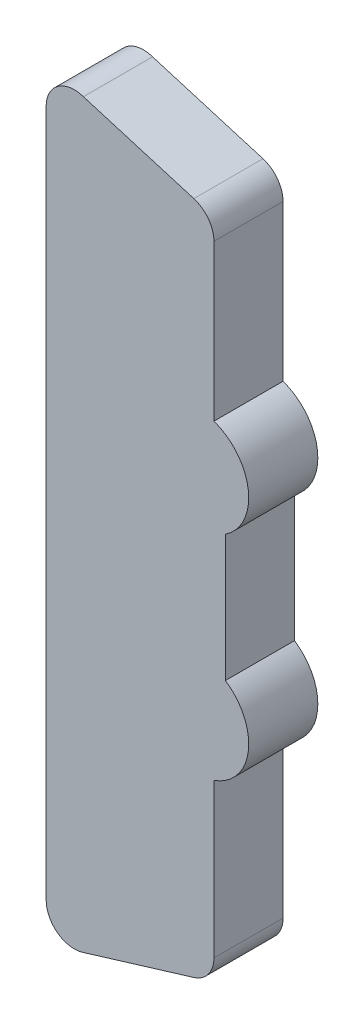
ISO-10303-21;
HEADER;
FILE_DESCRIPTION(('STEP AP214'),'2;1');
FILE_NAME('part.step','',(''),(''),'','','');
FILE_SCHEMA(('AUTOMOTIVE_DESIGN { 1 0 10303 214 1 1 1 1 }'));
ENDSEC;
DATA;
#1=APPLICATION_CONTEXT('core data for automotive mechanical design processes');
#2=APPLICATION_PROTOCOL_DEFINITION('international standard','automotive_design',2000,#1);
#3=PRODUCT_CONTEXT('',#1,'mechanical');
#4=PRODUCT('Part','Part','',(#3));
#5=PRODUCT_RELATED_PRODUCT_CATEGORY('part','',(#4));
#6=PRODUCT_DEFINITION_FORMATION('','',#4);
#7=PRODUCT_DEFINITION_CONTEXT('part definition',#1,'design');
#8=PRODUCT_DEFINITION('design','',#6,#7);
#9=PRODUCT_DEFINITION_SHAPE('','',#8);
#10=(LENGTH_UNIT() NAMED_UNIT(*) SI_UNIT(.MILLI.,.METRE.));
#11=(NAMED_UNIT(*) PLANE_ANGLE_UNIT() SI_UNIT($,.RADIAN.));
#12=(NAMED_UNIT(*) SI_UNIT($,.STERADIAN.) SOLID_ANGLE_UNIT());
#13=UNCERTAINTY_MEASURE_WITH_UNIT(LENGTH_MEASURE(1.E-05),#10,'distance_accuracy_value','');
#14=(GEOMETRIC_REPRESENTATION_CONTEXT(3) GLOBAL_UNCERTAINTY_ASSIGNED_CONTEXT((#13)) GLOBAL_UNIT_ASSIGNED_CONTEXT((#10,
#11,#12)) REPRESENTATION_CONTEXT('',''));
#15=CARTESIAN_POINT('',(0.,0.,0.));
#16=DIRECTION('',(0.,0.,1.));
#17=DIRECTION('',(1.,0.,0.));
#18=AXIS2_PLACEMENT_3D('',#15,#16,#17);
#19=CARTESIAN_POINT('',(1.843145736911,-2.901266792211,-6.124));
#20=DIRECTION('',(0.,0.,1.));
#21=DIRECTION('',(0.,-1.,0.));
#22=AXIS2_PLACEMENT_3D('',#19,#20,#21);
#23=CYLINDRICAL_SURFACE('',#22,0.898396092362);
#24=DIRECTION('',(0.,0.,-1.));
#25=VECTOR('',#24,1.);
#26=CARTESIAN_POINT('',(2.336495846622,-2.150453094933,-4.9));
#27=LINE('',#26,#25);
#28=CARTESIAN_POINT('',(2.336495846622,-2.150453094933,-4.9));
#29=VERTEX_POINT('',#28);
#30=CARTESIAN_POINT('',(2.336495846622,-2.150453094933,-6.1));
#31=VERTEX_POINT('',#30);
#32=EDGE_CURVE('E191',#29,#31,#27,.T.);
#33=ORIENTED_EDGE('',*,*,#32,.F.);
#34=CARTESIAN_POINT('',(1.843145736911,-2.901266792211,-4.9));
#35=DIRECTION('',(0.,0.,1.));
#36=DIRECTION('',(0.327867375855509,-0.944723760603925,0.));
#37=AXIS2_PLACEMENT_3D('',#34,#35,#36);
#38=CIRCLE('',#37,0.898396092362);
#39=CARTESIAN_POINT('',(2.137700506192,-3.7500029271,-4.9));
#40=VERTEX_POINT('',#39);
#41=EDGE_CURVE('E214',#40,#29,#38,.T.);
#42=ORIENTED_EDGE('',*,*,#41,.F.);
#43=DIRECTION('',(0.,0.,1.));
#44=VECTOR('',#43,1.);
#45=CARTESIAN_POINT('',(2.137700506192,-3.7500029271,-6.1));
#46=LINE('',#45,#44);
#47=CARTESIAN_POINT('',(2.137700506193,-3.750002927099,-6.1));
#48=VERTEX_POINT('',#47);
#49=EDGE_CURVE('E11',#48,#40,#46,.T.);
#50=ORIENTED_EDGE('',*,*,#49,.F.);
#51=CARTESIAN_POINT('',(1.843145736911,-2.901266792211,-6.1));
#52=DIRECTION('',(0.,0.,1.));
#53=DIRECTION('',(0.327867375855509,-0.944723760603925,0.));
#54=AXIS2_PLACEMENT_3D('',#51,#52,#53);
#55=CIRCLE('',#54,0.898396092362);
#56=EDGE_CURVE('E162',#48,#31,#55,.T.);
#57=ORIENTED_EDGE('',*,*,#56,.T.);
#58=EDGE_LOOP('',(#33,#42,#50,#57));
#59=FACE_BOUND('',#58,.T.);
#60=ADVANCED_FACE('F16',(#59),#23,.T.);
#61=CARTESIAN_POINT('',(2.137700506192,-5.085332010509,-5.5));
#62=DIRECTION('',(1.,0.,0.));
#63=DIRECTION('',(0.,1.,0.));
#64=AXIS2_PLACEMENT_3D('',#61,#62,#63);
#65=PLANE('',#64);
#66=ORIENTED_EDGE('',*,*,#49,.T.);
#67=DIRECTION('',(0.,1.,0.));
#68=VECTOR('',#67,1.);
#69=CARTESIAN_POINT('',(2.137700506192,-6.420661093917,-4.9));
#70=LINE('',#69,#68);
#71=CARTESIAN_POINT('',(2.137700506192,-6.420661093917,-4.9));
#72=VERTEX_POINT('',#71);
#73=EDGE_CURVE('E145',#72,#40,#70,.T.);
#74=ORIENTED_EDGE('',*,*,#73,.F.);
#75=DIRECTION('',(0.,0.,-1.));
#76=VECTOR('',#75,1.);
#77=CARTESIAN_POINT('',(2.137700506192,-6.420661093917,-4.9));
#78=LINE('',#77,#76);
#79=CARTESIAN_POINT('',(2.137700506192,-6.420661093917,-6.1));
#80=VERTEX_POINT('',#79);
#81=EDGE_CURVE('E27',#72,#80,#78,.T.);
#82=ORIENTED_EDGE('',*,*,#81,.T.);
#83=DIRECTION('',(0.,1.,0.));
#84=VECTOR('',#83,1.);
#85=CARTESIAN_POINT('',(2.137700506192,-6.420661093917,-6.1));
#86=LINE('',#85,#84);
#87=EDGE_CURVE('E142',#80,#48,#86,.T.);
#88=ORIENTED_EDGE('',*,*,#87,.T.);
#89=EDGE_LOOP('',(#66,#74,#82,#88));
#90=FACE_BOUND('',#89,.T.);
#91=ADVANCED_FACE('F140',(#90),#65,.T.);
#92=CARTESIAN_POINT('',(1.648694605368,-6.420661093918,-6.124));
#93=DIRECTION('',(0.,0.,1.));
#94=DIRECTION('',(0.,-1.,0.));
#95=AXIS2_PLACEMENT_3D('',#92,#93,#94);
#96=CYLINDRICAL_SURFACE('',#95,0.489005900824);
#97=ORIENTED_EDGE('',*,*,#81,.F.);
#98=CARTESIAN_POINT('',(1.648694605368,-6.420661093918,-4.9));
#99=DIRECTION('',(0.,0.,1.));
#100=DIRECTION('',(0.276992230070707,-0.960872158239824,0.));
#101=AXIS2_PLACEMENT_3D('',#98,#99,#100);
#102=CIRCLE('',#101,0.489005900824);
#103=CARTESIAN_POINT('',(1.784145440353,-6.890533249235,-4.9));
#104=VERTEX_POINT('',#103);
#105=EDGE_CURVE('E179',#104,#72,#102,.T.);
#106=ORIENTED_EDGE('',*,*,#105,.F.);
#107=DIRECTION('',(0.,0.,1.));
#108=VECTOR('',#107,1.);
#109=CARTESIAN_POINT('',(1.784145440353,-6.890533249235,-6.1));
#110=LINE('',#109,#108);
#111=CARTESIAN_POINT('',(1.784145440355,-6.890533249235,-6.1));
#112=VERTEX_POINT('',#111);
#113=EDGE_CURVE('E20',#112,#104,#110,.T.);
#114=ORIENTED_EDGE('',*,*,#113,.F.);
#115=CARTESIAN_POINT('',(1.648694605368,-6.420661093918,-6.1));
#116=DIRECTION('',(0.,0.,1.));
#117=DIRECTION('',(0.276992230070707,-0.960872158239824,0.));
#118=AXIS2_PLACEMENT_3D('',#115,#116,#117);
#119=CIRCLE('',#118,0.489005900824);
#120=EDGE_CURVE('E152',#112,#80,#119,.T.);
#121=ORIENTED_EDGE('',*,*,#120,.T.);
#122=EDGE_LOOP('',(#97,#106,#114,#121));
#123=FACE_BOUND('',#122,.T.);
#124=ADVANCED_FACE('F153',(#123),#96,.T.);
#125=CARTESIAN_POINT('',(0.8201642685116,-7.183462876419,-5.5));
#126=DIRECTION('',(-0.290747403268612,0.956799847142839,0.));
#127=DIRECTION('',(0.,0.,1.));
#128=AXIS2_PLACEMENT_3D('',#125,#126,#127);
#129=PLANE('',#128);
#130=ORIENTED_EDGE('',*,*,#113,.T.);
#131=DIRECTION('',(0.956799847142783,0.290747403268795,0.));
#132=VECTOR('',#131,1.);
#133=CARTESIAN_POINT('',(-0.1438169033289,-7.476392503602,-4.9));
#134=LINE('',#133,#132);
#135=CARTESIAN_POINT('',(-0.1438169033289,-7.476392503602,-4.9));
#136=VERTEX_POINT('',#135);
#137=EDGE_CURVE('E182',#136,#104,#134,.T.);
#138=ORIENTED_EDGE('',*,*,#137,.F.);
#139=DIRECTION('',(0.,0.,-1.));
#140=VECTOR('',#139,1.);
#141=CARTESIAN_POINT('',(-0.1438169033289,-7.476392503602,-4.9));
#142=LINE('',#141,#140);
#143=CARTESIAN_POINT('',(-0.1438169033289,-7.476392503602,-6.1));
#144=VERTEX_POINT('',#143);
#145=EDGE_CURVE('E257',#136,#144,#142,.T.);
#146=ORIENTED_EDGE('',*,*,#145,.T.);
#147=DIRECTION('',(0.956799847142783,0.290747403268795,0.));
#148=VECTOR('',#147,1.);
#149=CARTESIAN_POINT('',(-0.1438169033289,-7.476392503602,-6.1));
#150=LINE('',#149,#148);
#151=EDGE_CURVE('E158',#144,#112,#150,.T.);
#152=ORIENTED_EDGE('',*,*,#151,.T.);
#153=EDGE_LOOP('',(#130,#138,#146,#152));
#154=FACE_BOUND('',#153,.T.);
#155=ADVANCED_FACE('F333',(#154),#129,.F.);
#156=CARTESIAN_POINT('',(-0.2859940991763,-7.008511732442,-6.124));
#157=DIRECTION('',(0.,0.,1.));
#158=DIRECTION('',(0.,-1.,0.));
#159=AXIS2_PLACEMENT_3D('',#156,#157,#158);
#160=CYLINDRICAL_SURFACE('',#159,0.489005900824);
#161=ORIENTED_EDGE('',*,*,#145,.F.);
#162=CARTESIAN_POINT('',(-0.2859940991763,-7.008511732442,-4.9));
#163=DIRECTION('',(0.,0.,1.));
#164=DIRECTION('',(-1.,-8.18240388103E-12,0.));
#165=AXIS2_PLACEMENT_3D('',#162,#163,#164);
#166=CIRCLE('',#165,0.489005900824);
#167=CARTESIAN_POINT('',(-0.7749999999999,-7.008511732443,-4.9));
#168=VERTEX_POINT('',#167);
#169=EDGE_CURVE('E183',#168,#136,#166,.T.);
#170=ORIENTED_EDGE('',*,*,#169,.F.);
#171=DIRECTION('',(0.,0.,1.));
#172=VECTOR('',#171,1.);
#173=CARTESIAN_POINT('',(-0.7749999999999,-7.008511732443,-6.1));
#174=LINE('',#173,#172);
#175=CARTESIAN_POINT('',(-0.7750000000003,-7.008511732446,-6.1));
#176=VERTEX_POINT('',#175);
#177=EDGE_CURVE('E195',#176,#168,#174,.T.);
#178=ORIENTED_EDGE('',*,*,#177,.F.);
#179=CARTESIAN_POINT('',(-0.2859940991763,-7.008511732442,-6.1));
#180=DIRECTION('',(0.,0.,1.));
#181=DIRECTION('',(-1.,-8.18240388103E-12,0.));
#182=AXIS2_PLACEMENT_3D('',#179,#180,#181);
#183=CIRCLE('',#182,0.489005900824);
#184=EDGE_CURVE('E175',#176,#144,#183,.T.);
#185=ORIENTED_EDGE('',*,*,#184,.T.);
#186=EDGE_LOOP('',(#161,#170,#178,#185));
#187=FACE_BOUND('',#186,.T.);
#188=ADVANCED_FACE('F296',(#187),#160,.T.);
#189=CARTESIAN_POINT('',(-0.7749999999996,-1.037707341434,-5.5));
#190=DIRECTION('',(1.,0.,0.));
#191=DIRECTION('',(0.,1.,0.));
#192=AXIS2_PLACEMENT_3D('',#189,#190,#191);
#193=PLANE('',#192);
#194=ORIENTED_EDGE('',*,*,#177,.T.);
#195=DIRECTION('',(0.,-1.,0.));
#196=VECTOR('',#195,1.);
#197=CARTESIAN_POINT('',(-0.7749999999999,4.933097049575,-4.9));
#198=LINE('',#197,#196);
#199=CARTESIAN_POINT('',(-0.7749999999999,4.933097049575,-4.9));
#200=VERTEX_POINT('',#199);
#201=EDGE_CURVE('E187',#200,#168,#198,.T.);
#202=ORIENTED_EDGE('',*,*,#201,.F.);
#203=DIRECTION('',(0.,0.,-1.));
#204=VECTOR('',#203,1.);
#205=CARTESIAN_POINT('',(-0.7749999999999,4.933097049575,-4.9));
#206=LINE('',#205,#204);
#207=CARTESIAN_POINT('',(-0.7749999999999,4.933097049575,-6.1));
#208=VERTEX_POINT('',#207);
#209=EDGE_CURVE('E192',#200,#208,#206,.T.);
#210=ORIENTED_EDGE('',*,*,#209,.T.);
#211=DIRECTION('',(0.,-1.,0.));
#212=VECTOR('',#211,1.);
#213=CARTESIAN_POINT('',(-0.7749999999999,4.933097049575,-6.1));
#214=LINE('',#213,#212);
#215=EDGE_CURVE('E178',#208,#176,#214,.T.);
#216=ORIENTED_EDGE('',*,*,#215,.T.);
#217=EDGE_LOOP('',(#194,#202,#210,#216));
#218=FACE_BOUND('',#217,.T.);
#219=ADVANCED_FACE('F18',(#218),#193,.F.);
#220=CARTESIAN_POINT('',(-0.2859940991763,4.933097049574,-6.124));
#221=DIRECTION('',(0.,0.,1.));
#222=DIRECTION('',(0.,-1.,0.));
#223=AXIS2_PLACEMENT_3D('',#220,#221,#222);
#224=CYLINDRICAL_SURFACE('',#223,0.489005900824);
#225=ORIENTED_EDGE('',*,*,#209,.F.);
#226=CARTESIAN_POINT('',(-0.2859940991763,4.933097049574,-4.9));
#227=DIRECTION('',(0.,0.,1.));
#228=DIRECTION('',(-1.579040482591E-13,1.,0.));
#229=AXIS2_PLACEMENT_3D('',#226,#227,#228);
#230=CIRCLE('',#229,0.489005900824);
#231=CARTESIAN_POINT('',(-0.1277505710148,5.395791070323,-4.9));
#232=VERTEX_POINT('',#231);
#233=EDGE_CURVE('E222',#232,#200,#230,.T.);
#234=ORIENTED_EDGE('',*,*,#233,.F.);
#235=DIRECTION('',(0.,0.,1.));
#236=VECTOR('',#235,1.);
#237=CARTESIAN_POINT('',(-0.1277505710148,5.395791070323,-6.1));
#238=LINE('',#237,#236);
#239=CARTESIAN_POINT('',(-0.1277505709889,5.395791070313,-6.1));
#240=VERTEX_POINT('',#239);
#241=EDGE_CURVE('E173',#240,#232,#238,.T.);
#242=ORIENTED_EDGE('',*,*,#241,.F.);
#243=CARTESIAN_POINT('',(-0.2859940991763,4.933097049574,-6.1));
#244=DIRECTION('',(0.,0.,1.));
#245=DIRECTION('',(0.323602492159694,0.946193123557784,0.));
#246=AXIS2_PLACEMENT_3D('',#243,#244,#245);
#247=CIRCLE('',#246,0.489005900824);
#248=EDGE_CURVE('E196',#240,#208,#247,.T.);
#249=ORIENTED_EDGE('',*,*,#248,.T.);
#250=EDGE_LOOP('',(#225,#234,#242,#249));
#251=FACE_BOUND('',#250,.T.);
#252=ADVANCED_FACE('F306',(#251),#224,.T.);
#253=CARTESIAN_POINT('',(0.8305758915877,5.108977733794,-5.5));
#254=DIRECTION('',(0.286719952863708,0.958014440720928,0.));
#255=DIRECTION('',(0.,0.,-1.));
#256=AXIS2_PLACEMENT_3D('',#253,#254,#255);
#257=PLANE('',#256);
#258=ORIENTED_EDGE('',*,*,#241,.T.);
#259=DIRECTION('',(-0.958014440720928,0.286719952863708,0.));
#260=VECTOR('',#259,1.);
#261=CARTESIAN_POINT('',(1.788902354202,4.822164397262,-4.9));
#262=LINE('',#261,#260);
#263=CARTESIAN_POINT('',(1.788902354202,4.822164397262,-4.9));
#264=VERTEX_POINT('',#263);
#265=EDGE_CURVE('E205',#264,#232,#262,.T.);
#266=ORIENTED_EDGE('',*,*,#265,.F.);
#267=DIRECTION('',(0.,0.,-1.));
#268=VECTOR('',#267,1.);
#269=CARTESIAN_POINT('',(1.788902354202,4.822164397262,-4.9));
#270=LINE('',#269,#268);
#271=CARTESIAN_POINT('',(1.788902354202,4.822164397262,-6.1));
#272=VERTEX_POINT('',#271);
#273=EDGE_CURVE('E105',#264,#272,#270,.T.);
#274=ORIENTED_EDGE('',*,*,#273,.T.);
#275=DIRECTION('',(-0.958014440720928,0.286719952863708,0.));
#276=VECTOR('',#275,1.);
#277=CARTESIAN_POINT('',(1.788902354202,4.822164397262,-6.1));
#278=LINE('',#277,#276);
#279=EDGE_CURVE('E199',#272,#240,#278,.T.);
#280=ORIENTED_EDGE('',*,*,#279,.T.);
#281=EDGE_LOOP('',(#258,#266,#274,#280));
#282=FACE_BOUND('',#281,.T.);
#283=ADVANCED_FACE('F309',(#282),#257,.T.);
#284=CARTESIAN_POINT('',(1.648694605368,4.353689682675,-6.124));
#285=DIRECTION('',(0.,0.,1.));
#286=DIRECTION('',(0.,-1.,0.));
#287=AXIS2_PLACEMENT_3D('',#284,#285,#286);
#288=CYLINDRICAL_SURFACE('',#287,0.489005900824);
#289=ORIENTED_EDGE('',*,*,#273,.F.);
#290=CARTESIAN_POINT('',(1.648694605368,4.353689682675,-4.9));
#291=DIRECTION('',(0.,0.,1.));
#292=DIRECTION('',(1.,-6.139073278109E-12,0.));
#293=AXIS2_PLACEMENT_3D('',#290,#291,#292);
#294=CIRCLE('',#293,0.489005900824);
#295=CARTESIAN_POINT('',(2.137700506192,4.353689682674,-4.9));
#296=VERTEX_POINT('',#295);
#297=EDGE_CURVE('E201',#296,#264,#294,.T.);
#298=ORIENTED_EDGE('',*,*,#297,.F.);
#299=DIRECTION('',(0.,0.,1.));
#300=VECTOR('',#299,1.);
#301=CARTESIAN_POINT('',(2.137700506192,4.353689682674,-6.1));
#302=LINE('',#301,#300);
#303=CARTESIAN_POINT('',(2.137700506192,4.353689682672,-6.1));
#304=VERTEX_POINT('',#303);
#305=EDGE_CURVE('E94',#304,#296,#302,.T.);
#306=ORIENTED_EDGE('',*,*,#305,.F.);
#307=CARTESIAN_POINT('',(1.648694605368,4.353689682675,-6.1));
#308=DIRECTION('',(0.,0.,1.));
#309=DIRECTION('',(1.,-6.13725698424E-12,0.));
#310=AXIS2_PLACEMENT_3D('',#307,#308,#309);
#311=CIRCLE('',#310,0.489005900824);
#312=EDGE_CURVE('E243',#304,#272,#311,.T.);
#313=ORIENTED_EDGE('',*,*,#312,.T.);
#314=EDGE_LOOP('',(#289,#298,#306,#313));
#315=FACE_BOUND('',#314,.T.);
#316=ADVANCED_FACE('F273',(#315),#288,.T.);
#317=CARTESIAN_POINT('',(2.137700506192,3.001869792121,-5.5));
#318=DIRECTION('',(1.,0.,0.));
#319=DIRECTION('',(0.,1.,0.));
#320=AXIS2_PLACEMENT_3D('',#317,#318,#319);
#321=PLANE('',#320);
#322=ORIENTED_EDGE('',*,*,#305,.T.);
#323=DIRECTION('',(0.,1.,0.));
#324=VECTOR('',#323,1.);
#325=CARTESIAN_POINT('',(2.137700506192,1.650049901567,-4.9));
#326=LINE('',#325,#324);
#327=CARTESIAN_POINT('',(2.137700506192,1.650049901567,-4.9));
#328=VERTEX_POINT('',#327);
#329=EDGE_CURVE('E206',#328,#296,#326,.T.);
#330=ORIENTED_EDGE('',*,*,#329,.F.);
#331=DIRECTION('',(0.,0.,-1.));
#332=VECTOR('',#331,1.);
#333=CARTESIAN_POINT('',(2.137700506192,1.650049901567,-4.9));
#334=LINE('',#333,#332);
#335=CARTESIAN_POINT('',(2.137700506192,1.650049901567,-6.1));
#336=VERTEX_POINT('',#335);
#337=EDGE_CURVE('E41',#328,#336,#334,.T.);
#338=ORIENTED_EDGE('',*,*,#337,.T.);
#339=DIRECTION('',(0.,1.,0.));
#340=VECTOR('',#339,1.);
#341=CARTESIAN_POINT('',(2.137700506192,1.650049901567,-6.1));
#342=LINE('',#341,#340);
#343=EDGE_CURVE('E240',#336,#304,#342,.T.);
#344=ORIENTED_EDGE('',*,*,#343,.T.);
#345=EDGE_LOOP('',(#322,#330,#338,#344));
#346=FACE_BOUND('',#345,.T.);
#347=ADVANCED_FACE('F272',(#346),#321,.T.);
#348=CARTESIAN_POINT('',(1.843145736911,0.801313766678,-6.124));
#349=DIRECTION('',(0.,0.,1.));
#350=DIRECTION('',(0.,-1.,0.));
#351=AXIS2_PLACEMENT_3D('',#348,#349,#350);
#352=CYLINDRICAL_SURFACE('',#351,0.8983960923624);
#353=ORIENTED_EDGE('',*,*,#337,.F.);
#354=CARTESIAN_POINT('',(1.843145736911,0.801313766678,-4.9));
#355=DIRECTION('',(0.,0.,1.));
#356=DIRECTION('',(0.549145431403533,-0.83572680653945,0.));
#357=AXIS2_PLACEMENT_3D('',#354,#355,#356);
#358=CIRCLE('',#357,0.8983960923624);
#359=CARTESIAN_POINT('',(2.336495846622,0.05050006939991,-4.9));
#360=VERTEX_POINT('',#359);
#361=EDGE_CURVE('E218',#360,#328,#358,.T.);
#362=ORIENTED_EDGE('',*,*,#361,.F.);
#363=DIRECTION('',(0.,0.,1.));
#364=VECTOR('',#363,1.);
#365=CARTESIAN_POINT('',(2.336495846622,0.05050006939991,-6.1));
#366=LINE('',#365,#364);
#367=CARTESIAN_POINT('',(2.336495846622,0.05050006939991,-6.1));
#368=VERTEX_POINT('',#367);
#369=EDGE_CURVE('E223',#368,#360,#366,.T.);
#370=ORIENTED_EDGE('',*,*,#369,.F.);
#371=CARTESIAN_POINT('',(1.843145736911,0.801313766678,-6.1));
#372=DIRECTION('',(0.,0.,1.));
#373=DIRECTION('',(0.549145431403533,-0.83572680653945,0.));
#374=AXIS2_PLACEMENT_3D('',#371,#372,#373);
#375=CIRCLE('',#374,0.8983960923624);
#376=EDGE_CURVE('E235',#368,#336,#375,.T.);
#377=ORIENTED_EDGE('',*,*,#376,.T.);
#378=EDGE_LOOP('',(#353,#362,#370,#377));
#379=FACE_BOUND('',#378,.T.);
#380=ADVANCED_FACE('F270',(#379),#352,.T.);
#381=CARTESIAN_POINT('',(0.9833332052649,-1.037707341434,-6.1));
#382=DIRECTION('',(0.,0.,1.));
#383=DIRECTION('',(1.,0.,0.));
#384=AXIS2_PLACEMENT_3D('',#381,#382,#383);
#385=PLANE('',#384);
#386=ORIENTED_EDGE('',*,*,#56,.F.);
#387=ORIENTED_EDGE('',*,*,#87,.F.);
#388=ORIENTED_EDGE('',*,*,#120,.F.);
#389=ORIENTED_EDGE('',*,*,#151,.F.);
#390=ORIENTED_EDGE('',*,*,#184,.F.);
#391=ORIENTED_EDGE('',*,*,#215,.F.);
#392=ORIENTED_EDGE('',*,*,#248,.F.);
#393=ORIENTED_EDGE('',*,*,#279,.F.);
#394=ORIENTED_EDGE('',*,*,#312,.F.);
#395=ORIENTED_EDGE('',*,*,#343,.F.);
#396=ORIENTED_EDGE('',*,*,#376,.F.);
#397=DIRECTION('',(0.,1.,0.));
#398=VECTOR('',#397,1.);
#399=CARTESIAN_POINT('',(2.336495846622,-2.150453094933,-6.1));
#400=LINE('',#399,#398);
#401=EDGE_CURVE('E169',#31,#368,#400,.T.);
#402=ORIENTED_EDGE('',*,*,#401,.F.);
#403=EDGE_LOOP('',(#386,#387,#388,#389,#390,#391,#392,#393,#394,#395,#396,#402));
#404=FACE_BOUND('',#403,.T.);
#405=ADVANCED_FACE('F160',(#404),#385,.F.);
#406=CARTESIAN_POINT('',(2.336495846622,-1.049976512767,-5.5));
#407=DIRECTION('',(1.,0.,0.));
#408=DIRECTION('',(0.,1.,0.));
#409=AXIS2_PLACEMENT_3D('',#406,#407,#408);
#410=PLANE('',#409);
#411=ORIENTED_EDGE('',*,*,#369,.T.);
#412=DIRECTION('',(0.,1.,0.));
#413=VECTOR('',#412,1.);
#414=CARTESIAN_POINT('',(2.336495846622,-2.150453094933,-4.9));
#415=LINE('',#414,#413);
#416=EDGE_CURVE('E226',#29,#360,#415,.T.);
#417=ORIENTED_EDGE('',*,*,#416,.F.);
#418=ORIENTED_EDGE('',*,*,#32,.T.);
#419=ORIENTED_EDGE('',*,*,#401,.T.);
#420=EDGE_LOOP('',(#411,#417,#418,#419));
#421=FACE_BOUND('',#420,.T.);
#422=ADVANCED_FACE('F330',(#421),#410,.T.);
#423=CARTESIAN_POINT('',(0.9833332050899,-1.037707341434,-4.9));
#424=DIRECTION('',(0.,0.,1.));
#425=DIRECTION('',(1.,0.,0.));
#426=AXIS2_PLACEMENT_3D('',#423,#424,#425);
#427=PLANE('',#426);
#428=ORIENTED_EDGE('',*,*,#361,.T.);
#429=ORIENTED_EDGE('',*,*,#329,.T.);
#430=ORIENTED_EDGE('',*,*,#297,.T.);
#431=ORIENTED_EDGE('',*,*,#265,.T.);
#432=ORIENTED_EDGE('',*,*,#233,.T.);
#433=ORIENTED_EDGE('',*,*,#201,.T.);
#434=ORIENTED_EDGE('',*,*,#169,.T.);
#435=ORIENTED_EDGE('',*,*,#137,.T.);
#436=ORIENTED_EDGE('',*,*,#105,.T.);
#437=ORIENTED_EDGE('',*,*,#73,.T.);
#438=ORIENTED_EDGE('',*,*,#41,.T.);
#439=ORIENTED_EDGE('',*,*,#416,.T.);
#440=EDGE_LOOP('',(#428,#429,#430,#431,#432,#433,#434,#435,#436,#437,#438,#439));
#441=FACE_BOUND('',#440,.T.);
#442=ADVANCED_FACE('F265',(#441),#427,.T.);
#443=CLOSED_SHELL('',(#60,#91,#124,#155,#188,#219,#252,#283,#316,#347,#380,#405,#422,#442));
#444=MANIFOLD_SOLID_BREP('B1',#443);
#445=ADVANCED_BREP_SHAPE_REPRESENTATION('',(#18,#444),#14);
#446=SHAPE_DEFINITION_REPRESENTATION(#9,#445);
ENDSEC;
END-ISO-10303-21;
